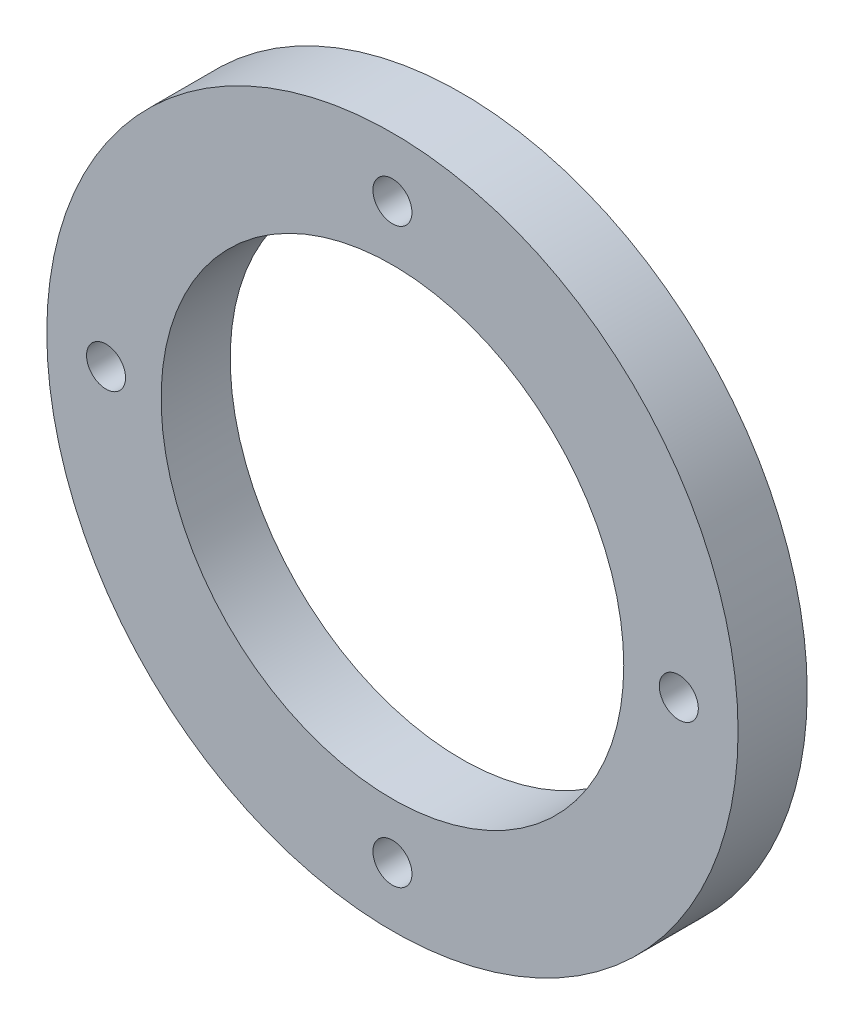
ISO-10303-21;
HEADER;
FILE_DESCRIPTION(('STEP AP214'),'2;1');
FILE_NAME('part.step','',(''),(''),'','','');
FILE_SCHEMA(('AUTOMOTIVE_DESIGN { 1 0 10303 214 1 1 1 1 }'));
ENDSEC;
DATA;
#1=APPLICATION_CONTEXT('core data for automotive mechanical design processes');
#2=APPLICATION_PROTOCOL_DEFINITION('international standard','automotive_design',2000,#1);
#3=PRODUCT_CONTEXT('',#1,'mechanical');
#4=PRODUCT('Part','Part','',(#3));
#5=PRODUCT_RELATED_PRODUCT_CATEGORY('part','',(#4));
#6=PRODUCT_DEFINITION_FORMATION('','',#4);
#7=PRODUCT_DEFINITION_CONTEXT('part definition',#1,'design');
#8=PRODUCT_DEFINITION('design','',#6,#7);
#9=PRODUCT_DEFINITION_SHAPE('','',#8);
#10=(LENGTH_UNIT() NAMED_UNIT(*) SI_UNIT(.MILLI.,.METRE.));
#11=(NAMED_UNIT(*) PLANE_ANGLE_UNIT() SI_UNIT($,.RADIAN.));
#12=(NAMED_UNIT(*) SI_UNIT($,.STERADIAN.) SOLID_ANGLE_UNIT());
#13=UNCERTAINTY_MEASURE_WITH_UNIT(LENGTH_MEASURE(1.E-05),#10,'distance_accuracy_value','');
#14=(GEOMETRIC_REPRESENTATION_CONTEXT(3) GLOBAL_UNCERTAINTY_ASSIGNED_CONTEXT((#13)) GLOBAL_UNIT_ASSIGNED_CONTEXT((#10,
#11,#12)) REPRESENTATION_CONTEXT('',''));
#15=CARTESIAN_POINT('',(0.,0.,0.));
#16=DIRECTION('',(0.,0.,1.));
#17=DIRECTION('',(1.,0.,0.));
#18=AXIS2_PLACEMENT_3D('',#15,#16,#17);
#19=CARTESIAN_POINT('',(0.,0.,0.));
#20=DIRECTION('',(0.,0.,1.));
#21=DIRECTION('',(1.,0.,0.));
#22=AXIS2_PLACEMENT_3D('',#19,#20,#21);
#23=PLANE('',#22);
#24=CARTESIAN_POINT('',(0.,0.,0.));
#25=DIRECTION('',(0.,0.,1.));
#26=DIRECTION('',(1.,0.,0.));
#27=AXIS2_PLACEMENT_3D('',#24,#25,#26);
#28=CIRCLE('',#27,35.);
#29=CARTESIAN_POINT('',(35.,0.,0.));
#30=VERTEX_POINT('',#29);
#31=EDGE_CURVE('E10',#30,#30,#28,.T.);
#32=ORIENTED_EDGE('',*,*,#31,.F.);
#33=EDGE_LOOP('',(#32));
#34=FACE_BOUND('',#33,.T.);
#35=CARTESIAN_POINT('',(0.,0.,0.));
#36=DIRECTION('',(0.,0.,1.));
#37=DIRECTION('',(1.,0.,0.));
#38=AXIS2_PLACEMENT_3D('',#35,#36,#37);
#39=CIRCLE('',#38,23.425);
#40=CARTESIAN_POINT('',(23.425,0.,0.));
#41=VERTEX_POINT('',#40);
#42=EDGE_CURVE('E39',#41,#41,#39,.T.);
#43=ORIENTED_EDGE('',*,*,#42,.T.);
#44=EDGE_LOOP('',(#43));
#45=FACE_BOUND('',#44,.T.);
#46=CARTESIAN_POINT('',(0.,29.,0.));
#47=DIRECTION('',(0.,0.,1.));
#48=DIRECTION('',(1.,0.,0.));
#49=AXIS2_PLACEMENT_3D('',#46,#47,#48);
#50=CIRCLE('',#49,1.975);
#51=CARTESIAN_POINT('',(1.975,29.,0.));
#52=VERTEX_POINT('',#51);
#53=EDGE_CURVE('E43',#52,#52,#50,.T.);
#54=ORIENTED_EDGE('',*,*,#53,.T.);
#55=EDGE_LOOP('',(#54));
#56=FACE_BOUND('',#55,.T.);
#57=CARTESIAN_POINT('',(29.0000000000008,8.18902359905425E-13,0.));
#58=DIRECTION('',(0.,0.,1.));
#59=DIRECTION('',(1.,0.,0.));
#60=AXIS2_PLACEMENT_3D('',#57,#58,#59);
#61=CIRCLE('',#60,1.97500000000064);
#62=CARTESIAN_POINT('',(30.9750000000015,8.18902359905425E-13,0.));
#63=VERTEX_POINT('',#62);
#64=EDGE_CURVE('E47',#63,#63,#61,.T.);
#65=ORIENTED_EDGE('',*,*,#64,.T.);
#66=EDGE_LOOP('',(#65));
#67=FACE_BOUND('',#66,.T.);
#68=CARTESIAN_POINT('',(1.63780471981085E-12,-29.,0.));
#69=DIRECTION('',(0.,0.,1.));
#70=DIRECTION('',(1.,0.,0.));
#71=AXIS2_PLACEMENT_3D('',#68,#69,#70);
#72=CIRCLE('',#71,1.97500000000176);
#73=CARTESIAN_POINT('',(1.9750000000034,-29.,0.));
#74=VERTEX_POINT('',#73);
#75=EDGE_CURVE('E52',#74,#74,#72,.T.);
#76=ORIENTED_EDGE('',*,*,#75,.T.);
#77=EDGE_LOOP('',(#76));
#78=FACE_BOUND('',#77,.T.);
#79=CARTESIAN_POINT('',(-28.9999999999992,-8.22453835622952E-13,0.));
#80=DIRECTION('',(0.,0.,1.));
#81=DIRECTION('',(1.,0.,0.));
#82=AXIS2_PLACEMENT_3D('',#79,#80,#81);
#83=CIRCLE('',#82,1.97500000000132);
#84=CARTESIAN_POINT('',(-27.0249999999979,-8.22453835622952E-13,0.));
#85=VERTEX_POINT('',#84);
#86=EDGE_CURVE('E55',#85,#85,#83,.T.);
#87=ORIENTED_EDGE('',*,*,#86,.T.);
#88=EDGE_LOOP('',(#87));
#89=FACE_BOUND('',#88,.T.);
#90=ADVANCED_FACE('F32',(#34,#45,#56,#67,#78,#89),#23,.F.);
#91=CARTESIAN_POINT('',(0.,0.,5.));
#92=DIRECTION('',(0.,0.,-1.));
#93=DIRECTION('',(-1.,0.,0.));
#94=AXIS2_PLACEMENT_3D('',#91,#92,#93);
#95=CYLINDRICAL_SURFACE('',#94,35.);
#96=ORIENTED_EDGE('',*,*,#31,.T.);
#97=EDGE_LOOP('',(#96));
#98=FACE_BOUND('',#97,.T.);
#99=CARTESIAN_POINT('',(0.,0.,7.));
#100=DIRECTION('',(0.,0.,1.));
#101=DIRECTION('',(1.,0.,0.));
#102=AXIS2_PLACEMENT_3D('',#99,#100,#101);
#103=CIRCLE('',#102,35.);
#104=CARTESIAN_POINT('',(35.,0.,7.));
#105=VERTEX_POINT('',#104);
#106=EDGE_CURVE('E58',#105,#105,#103,.T.);
#107=ORIENTED_EDGE('',*,*,#106,.F.);
#108=EDGE_LOOP('',(#107));
#109=FACE_BOUND('',#108,.T.);
#110=ADVANCED_FACE('F34',(#98,#109),#95,.T.);
#111=CARTESIAN_POINT('',(0.,0.,5.));
#112=DIRECTION('',(0.,0.,-1.));
#113=DIRECTION('',(-1.,0.,0.));
#114=AXIS2_PLACEMENT_3D('',#111,#112,#113);
#115=CYLINDRICAL_SURFACE('',#114,23.425);
#116=ORIENTED_EDGE('',*,*,#42,.F.);
#117=EDGE_LOOP('',(#116));
#118=FACE_BOUND('',#117,.T.);
#119=CARTESIAN_POINT('',(0.,0.,7.));
#120=DIRECTION('',(0.,0.,1.));
#121=DIRECTION('',(1.,0.,0.));
#122=AXIS2_PLACEMENT_3D('',#119,#120,#121);
#123=CIRCLE('',#122,23.425);
#124=CARTESIAN_POINT('',(23.425,0.,7.));
#125=VERTEX_POINT('',#124);
#126=EDGE_CURVE('E61',#125,#125,#123,.T.);
#127=ORIENTED_EDGE('',*,*,#126,.T.);
#128=EDGE_LOOP('',(#127));
#129=FACE_BOUND('',#128,.T.);
#130=ADVANCED_FACE('F96',(#118,#129),#115,.F.);
#131=CARTESIAN_POINT('',(0.,29.,5.));
#132=DIRECTION('',(0.,0.,-1.));
#133=DIRECTION('',(-1.,0.,0.));
#134=AXIS2_PLACEMENT_3D('',#131,#132,#133);
#135=CYLINDRICAL_SURFACE('',#134,1.975);
#136=ORIENTED_EDGE('',*,*,#53,.F.);
#137=EDGE_LOOP('',(#136));
#138=FACE_BOUND('',#137,.T.);
#139=CARTESIAN_POINT('',(0.,29.,7.));
#140=DIRECTION('',(0.,0.,1.));
#141=DIRECTION('',(1.,0.,0.));
#142=AXIS2_PLACEMENT_3D('',#139,#140,#141);
#143=CIRCLE('',#142,1.975);
#144=CARTESIAN_POINT('',(1.975,29.,7.));
#145=VERTEX_POINT('',#144);
#146=EDGE_CURVE('E64',#145,#145,#143,.T.);
#147=ORIENTED_EDGE('',*,*,#146,.T.);
#148=EDGE_LOOP('',(#147));
#149=FACE_BOUND('',#148,.T.);
#150=ADVANCED_FACE('F100',(#138,#149),#135,.F.);
#151=CARTESIAN_POINT('',(29.0000000000008,8.18902359905425E-13,5.));
#152=DIRECTION('',(0.,0.,-1.));
#153=DIRECTION('',(-1.,0.,0.));
#154=AXIS2_PLACEMENT_3D('',#151,#152,#153);
#155=CYLINDRICAL_SURFACE('',#154,1.97500000000064);
#156=ORIENTED_EDGE('',*,*,#64,.F.);
#157=EDGE_LOOP('',(#156));
#158=FACE_BOUND('',#157,.T.);
#159=CARTESIAN_POINT('',(29.0000000000008,8.18902359905425E-13,7.));
#160=DIRECTION('',(0.,0.,1.));
#161=DIRECTION('',(1.,0.,0.));
#162=AXIS2_PLACEMENT_3D('',#159,#160,#161);
#163=CIRCLE('',#162,1.97500000000064);
#164=CARTESIAN_POINT('',(30.9750000000015,8.18902359905425E-13,7.));
#165=VERTEX_POINT('',#164);
#166=EDGE_CURVE('E67',#165,#165,#163,.T.);
#167=ORIENTED_EDGE('',*,*,#166,.T.);
#168=EDGE_LOOP('',(#167));
#169=FACE_BOUND('',#168,.T.);
#170=ADVANCED_FACE('F104',(#158,#169),#155,.F.);
#171=CARTESIAN_POINT('',(1.63780471981085E-12,-29.,5.));
#172=DIRECTION('',(0.,0.,-1.));
#173=DIRECTION('',(-1.,0.,0.));
#174=AXIS2_PLACEMENT_3D('',#171,#172,#173);
#175=CYLINDRICAL_SURFACE('',#174,1.97500000000176);
#176=ORIENTED_EDGE('',*,*,#75,.F.);
#177=EDGE_LOOP('',(#176));
#178=FACE_BOUND('',#177,.T.);
#179=CARTESIAN_POINT('',(1.63780471981085E-12,-29.,7.));
#180=DIRECTION('',(0.,0.,1.));
#181=DIRECTION('',(1.,0.,0.));
#182=AXIS2_PLACEMENT_3D('',#179,#180,#181);
#183=CIRCLE('',#182,1.97500000000176);
#184=CARTESIAN_POINT('',(1.9750000000034,-29.,7.));
#185=VERTEX_POINT('',#184);
#186=EDGE_CURVE('E70',#185,#185,#183,.T.);
#187=ORIENTED_EDGE('',*,*,#186,.T.);
#188=EDGE_LOOP('',(#187));
#189=FACE_BOUND('',#188,.T.);
#190=ADVANCED_FACE('F86',(#178,#189),#175,.F.);
#191=CARTESIAN_POINT('',(-28.9999999999992,-8.22453835622952E-13,5.));
#192=DIRECTION('',(0.,0.,-1.));
#193=DIRECTION('',(-1.,0.,0.));
#194=AXIS2_PLACEMENT_3D('',#191,#192,#193);
#195=CYLINDRICAL_SURFACE('',#194,1.97500000000132);
#196=ORIENTED_EDGE('',*,*,#86,.F.);
#197=EDGE_LOOP('',(#196));
#198=FACE_BOUND('',#197,.T.);
#199=CARTESIAN_POINT('',(-28.9999999999992,-8.22453835622952E-13,7.));
#200=DIRECTION('',(0.,0.,1.));
#201=DIRECTION('',(1.,0.,0.));
#202=AXIS2_PLACEMENT_3D('',#199,#200,#201);
#203=CIRCLE('',#202,1.97500000000132);
#204=CARTESIAN_POINT('',(-27.0249999999979,-8.22453835622952E-13,7.));
#205=VERTEX_POINT('',#204);
#206=EDGE_CURVE('E73',#205,#205,#203,.T.);
#207=ORIENTED_EDGE('',*,*,#206,.T.);
#208=EDGE_LOOP('',(#207));
#209=FACE_BOUND('',#208,.T.);
#210=ADVANCED_FACE('F77',(#198,#209),#195,.F.);
#211=CARTESIAN_POINT('',(0.,0.,7.));
#212=DIRECTION('',(0.,0.,1.));
#213=DIRECTION('',(1.,0.,0.));
#214=AXIS2_PLACEMENT_3D('',#211,#212,#213);
#215=PLANE('',#214);
#216=ORIENTED_EDGE('',*,*,#186,.F.);
#217=EDGE_LOOP('',(#216));
#218=FACE_BOUND('',#217,.T.);
#219=ORIENTED_EDGE('',*,*,#146,.F.);
#220=EDGE_LOOP('',(#219));
#221=FACE_BOUND('',#220,.T.);
#222=ORIENTED_EDGE('',*,*,#106,.T.);
#223=EDGE_LOOP('',(#222));
#224=FACE_BOUND('',#223,.T.);
#225=ORIENTED_EDGE('',*,*,#126,.F.);
#226=EDGE_LOOP('',(#225));
#227=FACE_BOUND('',#226,.T.);
#228=ORIENTED_EDGE('',*,*,#166,.F.);
#229=EDGE_LOOP('',(#228));
#230=FACE_BOUND('',#229,.T.);
#231=ORIENTED_EDGE('',*,*,#206,.F.);
#232=EDGE_LOOP('',(#231));
#233=FACE_BOUND('',#232,.T.);
#234=ADVANCED_FACE('F79',(#218,#221,#224,#227,#230,#233),#215,.T.);
#235=CLOSED_SHELL('',(#90,#110,#130,#150,#170,#190,#210,#234));
#236=MANIFOLD_SOLID_BREP('B2',#235);
#237=ADVANCED_BREP_SHAPE_REPRESENTATION('',(#18,#236),#14);
#238=SHAPE_DEFINITION_REPRESENTATION(#9,#237);
ENDSEC;
END-ISO-10303-21;
